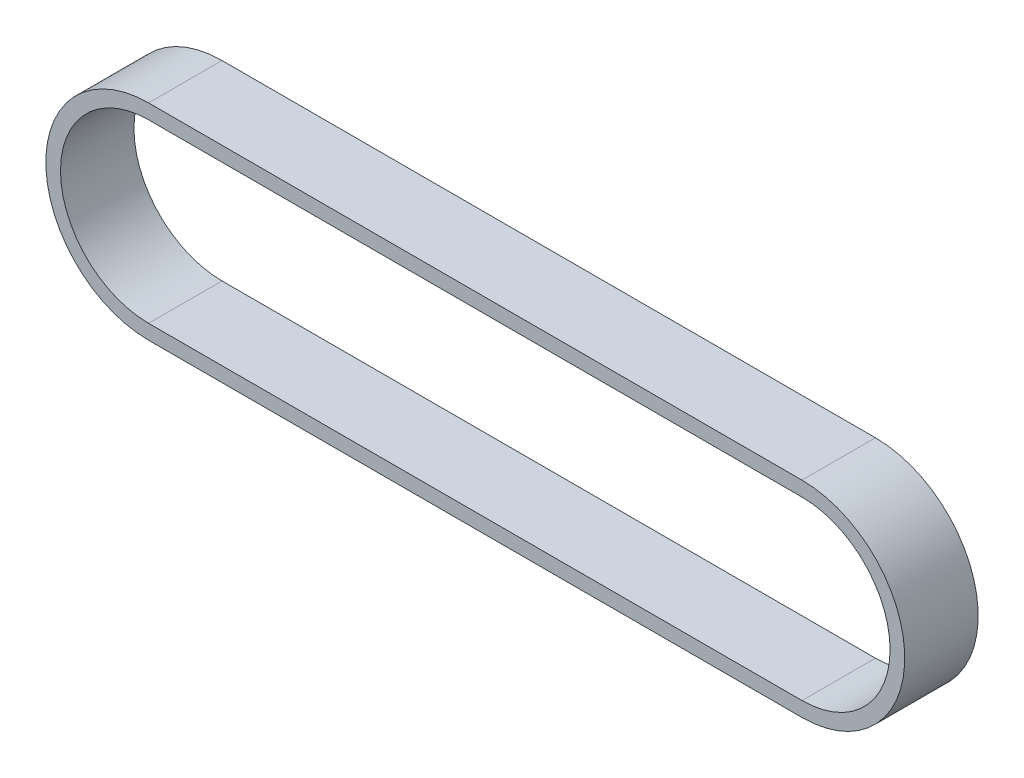
ISO-10303-21;
HEADER;
FILE_DESCRIPTION(('STEP AP214'),'2;1');
FILE_NAME('part.step','',(''),(''),'','','');
FILE_SCHEMA(('AUTOMOTIVE_DESIGN { 1 0 10303 214 1 1 1 1 }'));
ENDSEC;
DATA;
#1=APPLICATION_CONTEXT('core data for automotive mechanical design processes');
#2=APPLICATION_PROTOCOL_DEFINITION('international standard','automotive_design',2000,#1);
#3=PRODUCT_CONTEXT('',#1,'mechanical');
#4=PRODUCT('Part','Part','',(#3));
#5=PRODUCT_RELATED_PRODUCT_CATEGORY('part','',(#4));
#6=PRODUCT_DEFINITION_FORMATION('','',#4);
#7=PRODUCT_DEFINITION_CONTEXT('part definition',#1,'design');
#8=PRODUCT_DEFINITION('design','',#6,#7);
#9=PRODUCT_DEFINITION_SHAPE('','',#8);
#10=(LENGTH_UNIT() NAMED_UNIT(*) SI_UNIT(.MILLI.,.METRE.));
#11=(NAMED_UNIT(*) PLANE_ANGLE_UNIT() SI_UNIT($,.RADIAN.));
#12=(NAMED_UNIT(*) SI_UNIT($,.STERADIAN.) SOLID_ANGLE_UNIT());
#13=UNCERTAINTY_MEASURE_WITH_UNIT(LENGTH_MEASURE(1.E-05),#10,'distance_accuracy_value','');
#14=(GEOMETRIC_REPRESENTATION_CONTEXT(3) GLOBAL_UNCERTAINTY_ASSIGNED_CONTEXT((#13)) GLOBAL_UNIT_ASSIGNED_CONTEXT((#10,
#11,#12)) REPRESENTATION_CONTEXT('',''));
#15=CARTESIAN_POINT('',(0.,0.,0.));
#16=DIRECTION('',(0.,0.,1.));
#17=DIRECTION('',(1.,0.,0.));
#18=AXIS2_PLACEMENT_3D('',#15,#16,#17);
#19=CARTESIAN_POINT('',(0.,0.,10.));
#20=DIRECTION('',(0.,0.,1.));
#21=DIRECTION('',(1.,0.,0.));
#22=AXIS2_PLACEMENT_3D('',#19,#20,#21);
#23=PLANE('',#22);
#24=CARTESIAN_POINT('',(0.,0.,10.));
#25=DIRECTION('',(0.,0.,1.));
#26=DIRECTION('',(1.,0.,0.));
#27=AXIS2_PLACEMENT_3D('',#24,#25,#26);
#28=CIRCLE('',#27,14.);
#29=CARTESIAN_POINT('',(0.,14.,10.));
#30=VERTEX_POINT('',#29);
#31=CARTESIAN_POINT('',(0.,-14.,10.));
#32=VERTEX_POINT('',#31);
#33=EDGE_CURVE('E144',#30,#32,#28,.T.);
#34=ORIENTED_EDGE('',*,*,#33,.T.);
#35=DIRECTION('',(1.,0.,0.));
#36=VECTOR('',#35,1.);
#37=CARTESIAN_POINT('',(0.,-14.,10.));
#38=LINE('',#37,#36);
#39=CARTESIAN_POINT('',(89.,-14.,10.));
#40=VERTEX_POINT('',#39);
#41=EDGE_CURVE('E147',#32,#40,#38,.T.);
#42=ORIENTED_EDGE('',*,*,#41,.T.);
#43=CARTESIAN_POINT('',(89.,0.,10.));
#44=DIRECTION('',(0.,0.,1.));
#45=DIRECTION('',(1.,0.,0.));
#46=AXIS2_PLACEMENT_3D('',#43,#44,#45);
#47=CIRCLE('',#46,14.);
#48=CARTESIAN_POINT('',(89.,14.,10.));
#49=VERTEX_POINT('',#48);
#50=EDGE_CURVE('E150',#40,#49,#47,.T.);
#51=ORIENTED_EDGE('',*,*,#50,.T.);
#52=DIRECTION('',(-1.,0.,0.));
#53=VECTOR('',#52,1.);
#54=CARTESIAN_POINT('',(0.,14.,10.));
#55=LINE('',#54,#53);
#56=EDGE_CURVE('E152',#49,#30,#55,.T.);
#57=ORIENTED_EDGE('',*,*,#56,.T.);
#58=EDGE_LOOP('',(#34,#42,#51,#57));
#59=FACE_BOUND('',#58,.T.);
#60=DIRECTION('',(1.,0.,0.));
#61=VECTOR('',#60,1.);
#62=CARTESIAN_POINT('',(0.,-12.,10.));
#63=LINE('',#62,#61);
#64=CARTESIAN_POINT('',(0.,-12.,10.));
#65=VERTEX_POINT('',#64);
#66=CARTESIAN_POINT('',(89.,-12.,10.));
#67=VERTEX_POINT('',#66);
#68=EDGE_CURVE('E116',#65,#67,#63,.T.);
#69=ORIENTED_EDGE('',*,*,#68,.F.);
#70=CARTESIAN_POINT('',(0.,0.,10.));
#71=DIRECTION('',(0.,0.,1.));
#72=DIRECTION('',(1.,0.,0.));
#73=AXIS2_PLACEMENT_3D('',#70,#71,#72);
#74=CIRCLE('',#73,12.);
#75=CARTESIAN_POINT('',(0.,12.,10.));
#76=VERTEX_POINT('',#75);
#77=EDGE_CURVE('E108',#76,#65,#74,.T.);
#78=ORIENTED_EDGE('',*,*,#77,.F.);
#79=DIRECTION('',(-1.,0.,0.));
#80=VECTOR('',#79,1.);
#81=CARTESIAN_POINT('',(0.,12.,10.));
#82=LINE('',#81,#80);
#83=CARTESIAN_POINT('',(89.,12.,10.));
#84=VERTEX_POINT('',#83);
#85=EDGE_CURVE('E130',#84,#76,#82,.T.);
#86=ORIENTED_EDGE('',*,*,#85,.F.);
#87=CARTESIAN_POINT('',(89.,0.,10.));
#88=DIRECTION('',(0.,0.,1.));
#89=DIRECTION('',(1.,0.,0.));
#90=AXIS2_PLACEMENT_3D('',#87,#88,#89);
#91=CIRCLE('',#90,12.);
#92=EDGE_CURVE('E128',#67,#84,#91,.T.);
#93=ORIENTED_EDGE('',*,*,#92,.F.);
#94=EDGE_LOOP('',(#69,#78,#86,#93));
#95=FACE_BOUND('',#94,.T.);
#96=ADVANCED_FACE('F43',(#59,#95),#23,.T.);
#97=CARTESIAN_POINT('',(0.,0.,0.));
#98=DIRECTION('',(0.,0.,1.));
#99=DIRECTION('',(1.,0.,0.));
#100=AXIS2_PLACEMENT_3D('',#97,#98,#99);
#101=PLANE('',#100);
#102=CARTESIAN_POINT('',(0.,0.,0.));
#103=DIRECTION('',(0.,0.,1.));
#104=DIRECTION('',(1.,0.,0.));
#105=AXIS2_PLACEMENT_3D('',#102,#103,#104);
#106=CIRCLE('',#105,14.);
#107=CARTESIAN_POINT('',(0.,14.,0.));
#108=VERTEX_POINT('',#107);
#109=CARTESIAN_POINT('',(0.,-14.,0.));
#110=VERTEX_POINT('',#109);
#111=EDGE_CURVE('E124',#108,#110,#106,.T.);
#112=ORIENTED_EDGE('',*,*,#111,.F.);
#113=DIRECTION('',(-1.,0.,0.));
#114=VECTOR('',#113,1.);
#115=CARTESIAN_POINT('',(0.,14.,0.));
#116=LINE('',#115,#114);
#117=CARTESIAN_POINT('',(89.,14.,0.));
#118=VERTEX_POINT('',#117);
#119=EDGE_CURVE('E148',#118,#108,#116,.T.);
#120=ORIENTED_EDGE('',*,*,#119,.F.);
#121=CARTESIAN_POINT('',(89.,0.,0.));
#122=DIRECTION('',(0.,0.,1.));
#123=DIRECTION('',(1.,0.,0.));
#124=AXIS2_PLACEMENT_3D('',#121,#122,#123);
#125=CIRCLE('',#124,14.);
#126=CARTESIAN_POINT('',(89.,-14.,0.));
#127=VERTEX_POINT('',#126);
#128=EDGE_CURVE('E159',#127,#118,#125,.T.);
#129=ORIENTED_EDGE('',*,*,#128,.F.);
#130=DIRECTION('',(1.,0.,0.));
#131=VECTOR('',#130,1.);
#132=CARTESIAN_POINT('',(0.,-14.,0.));
#133=LINE('',#132,#131);
#134=EDGE_CURVE('E157',#110,#127,#133,.T.);
#135=ORIENTED_EDGE('',*,*,#134,.F.);
#136=EDGE_LOOP('',(#112,#120,#129,#135));
#137=FACE_BOUND('',#136,.T.);
#138=CARTESIAN_POINT('',(0.,0.,0.));
#139=DIRECTION('',(0.,0.,1.));
#140=DIRECTION('',(1.,0.,0.));
#141=AXIS2_PLACEMENT_3D('',#138,#139,#140);
#142=CIRCLE('',#141,12.);
#143=CARTESIAN_POINT('',(0.,12.,0.));
#144=VERTEX_POINT('',#143);
#145=CARTESIAN_POINT('',(0.,-12.,0.));
#146=VERTEX_POINT('',#145);
#147=EDGE_CURVE('E66',#144,#146,#142,.T.);
#148=ORIENTED_EDGE('',*,*,#147,.T.);
#149=DIRECTION('',(1.,0.,0.));
#150=VECTOR('',#149,1.);
#151=CARTESIAN_POINT('',(0.,-12.,0.));
#152=LINE('',#151,#150);
#153=CARTESIAN_POINT('',(89.,-12.,0.));
#154=VERTEX_POINT('',#153);
#155=EDGE_CURVE('E123',#146,#154,#152,.T.);
#156=ORIENTED_EDGE('',*,*,#155,.T.);
#157=CARTESIAN_POINT('',(89.,0.,0.));
#158=DIRECTION('',(0.,0.,1.));
#159=DIRECTION('',(1.,0.,0.));
#160=AXIS2_PLACEMENT_3D('',#157,#158,#159);
#161=CIRCLE('',#160,12.);
#162=CARTESIAN_POINT('',(89.,12.,0.));
#163=VERTEX_POINT('',#162);
#164=EDGE_CURVE('E136',#154,#163,#161,.T.);
#165=ORIENTED_EDGE('',*,*,#164,.T.);
#166=DIRECTION('',(-1.,0.,0.));
#167=VECTOR('',#166,1.);
#168=CARTESIAN_POINT('',(0.,12.,0.));
#169=LINE('',#168,#167);
#170=EDGE_CURVE('E117',#163,#144,#169,.T.);
#171=ORIENTED_EDGE('',*,*,#170,.T.);
#172=EDGE_LOOP('',(#148,#156,#165,#171));
#173=FACE_BOUND('',#172,.T.);
#174=ADVANCED_FACE('F177',(#137,#173),#101,.F.);
#175=CARTESIAN_POINT('',(0.,0.,10.));
#176=DIRECTION('',(0.,0.,-1.));
#177=DIRECTION('',(-1.,0.,0.));
#178=AXIS2_PLACEMENT_3D('',#175,#176,#177);
#179=CYLINDRICAL_SURFACE('',#178,14.);
#180=ORIENTED_EDGE('',*,*,#111,.T.);
#181=DIRECTION('',(0.,0.,-1.));
#182=VECTOR('',#181,1.);
#183=CARTESIAN_POINT('',(0.,-14.,10.));
#184=LINE('',#183,#182);
#185=EDGE_CURVE('E11',#32,#110,#184,.T.);
#186=ORIENTED_EDGE('',*,*,#185,.F.);
#187=ORIENTED_EDGE('',*,*,#33,.F.);
#188=DIRECTION('',(0.,0.,-1.));
#189=VECTOR('',#188,1.);
#190=CARTESIAN_POINT('',(0.,14.,10.));
#191=LINE('',#190,#189);
#192=EDGE_CURVE('E154',#30,#108,#191,.T.);
#193=ORIENTED_EDGE('',*,*,#192,.T.);
#194=EDGE_LOOP('',(#180,#186,#187,#193));
#195=FACE_BOUND('',#194,.T.);
#196=ADVANCED_FACE('F45',(#195),#179,.T.);
#197=CARTESIAN_POINT('',(0.,-14.,10.));
#198=DIRECTION('',(0.,1.,0.));
#199=DIRECTION('',(0.,0.,1.));
#200=AXIS2_PLACEMENT_3D('',#197,#198,#199);
#201=PLANE('',#200);
#202=ORIENTED_EDGE('',*,*,#134,.T.);
#203=DIRECTION('',(0.,0.,-1.));
#204=VECTOR('',#203,1.);
#205=CARTESIAN_POINT('',(89.,-14.,10.));
#206=LINE('',#205,#204);
#207=EDGE_CURVE('E51',#40,#127,#206,.T.);
#208=ORIENTED_EDGE('',*,*,#207,.F.);
#209=ORIENTED_EDGE('',*,*,#41,.F.);
#210=ORIENTED_EDGE('',*,*,#185,.T.);
#211=EDGE_LOOP('',(#202,#208,#209,#210));
#212=FACE_BOUND('',#211,.T.);
#213=ADVANCED_FACE('F187',(#212),#201,.F.);
#214=CARTESIAN_POINT('',(89.,0.,10.));
#215=DIRECTION('',(0.,0.,-1.));
#216=DIRECTION('',(-1.,0.,0.));
#217=AXIS2_PLACEMENT_3D('',#214,#215,#216);
#218=CYLINDRICAL_SURFACE('',#217,14.);
#219=ORIENTED_EDGE('',*,*,#128,.T.);
#220=DIRECTION('',(0.,0.,-1.));
#221=VECTOR('',#220,1.);
#222=CARTESIAN_POINT('',(89.,14.,10.));
#223=LINE('',#222,#221);
#224=EDGE_CURVE('E164',#49,#118,#223,.T.);
#225=ORIENTED_EDGE('',*,*,#224,.F.);
#226=ORIENTED_EDGE('',*,*,#50,.F.);
#227=ORIENTED_EDGE('',*,*,#207,.T.);
#228=EDGE_LOOP('',(#219,#225,#226,#227));
#229=FACE_BOUND('',#228,.T.);
#230=ADVANCED_FACE('F171',(#229),#218,.T.);
#231=CARTESIAN_POINT('',(0.,14.,10.));
#232=DIRECTION('',(0.,-1.,0.));
#233=DIRECTION('',(0.,0.,-1.));
#234=AXIS2_PLACEMENT_3D('',#231,#232,#233);
#235=PLANE('',#234);
#236=ORIENTED_EDGE('',*,*,#119,.T.);
#237=ORIENTED_EDGE('',*,*,#192,.F.);
#238=ORIENTED_EDGE('',*,*,#56,.F.);
#239=ORIENTED_EDGE('',*,*,#224,.T.);
#240=EDGE_LOOP('',(#236,#237,#238,#239));
#241=FACE_BOUND('',#240,.T.);
#242=ADVANCED_FACE('F181',(#241),#235,.F.);
#243=CARTESIAN_POINT('',(0.,0.,10.));
#244=DIRECTION('',(0.,0.,-1.));
#245=DIRECTION('',(-1.,0.,0.));
#246=AXIS2_PLACEMENT_3D('',#243,#244,#245);
#247=CYLINDRICAL_SURFACE('',#246,12.);
#248=ORIENTED_EDGE('',*,*,#147,.F.);
#249=DIRECTION('',(0.,0.,-1.));
#250=VECTOR('',#249,1.);
#251=CARTESIAN_POINT('',(0.,12.,10.));
#252=LINE('',#251,#250);
#253=EDGE_CURVE('E112',#76,#144,#252,.T.);
#254=ORIENTED_EDGE('',*,*,#253,.F.);
#255=ORIENTED_EDGE('',*,*,#77,.T.);
#256=DIRECTION('',(0.,0.,-1.));
#257=VECTOR('',#256,1.);
#258=CARTESIAN_POINT('',(0.,-12.,10.));
#259=LINE('',#258,#257);
#260=EDGE_CURVE('E111',#65,#146,#259,.T.);
#261=ORIENTED_EDGE('',*,*,#260,.T.);
#262=EDGE_LOOP('',(#248,#254,#255,#261));
#263=FACE_BOUND('',#262,.T.);
#264=ADVANCED_FACE('F110',(#263),#247,.F.);
#265=CARTESIAN_POINT('',(0.,-12.,10.));
#266=DIRECTION('',(0.,1.,0.));
#267=DIRECTION('',(0.,0.,1.));
#268=AXIS2_PLACEMENT_3D('',#265,#266,#267);
#269=PLANE('',#268);
#270=ORIENTED_EDGE('',*,*,#155,.F.);
#271=ORIENTED_EDGE('',*,*,#260,.F.);
#272=ORIENTED_EDGE('',*,*,#68,.T.);
#273=DIRECTION('',(0.,0.,-1.));
#274=VECTOR('',#273,1.);
#275=CARTESIAN_POINT('',(89.,-12.,10.));
#276=LINE('',#275,#274);
#277=EDGE_CURVE('E125',#67,#154,#276,.T.);
#278=ORIENTED_EDGE('',*,*,#277,.T.);
#279=EDGE_LOOP('',(#270,#271,#272,#278));
#280=FACE_BOUND('',#279,.T.);
#281=ADVANCED_FACE('F120',(#280),#269,.T.);
#282=CARTESIAN_POINT('',(89.,0.,10.));
#283=DIRECTION('',(0.,0.,-1.));
#284=DIRECTION('',(-1.,0.,0.));
#285=AXIS2_PLACEMENT_3D('',#282,#283,#284);
#286=CYLINDRICAL_SURFACE('',#285,12.);
#287=ORIENTED_EDGE('',*,*,#164,.F.);
#288=ORIENTED_EDGE('',*,*,#277,.F.);
#289=ORIENTED_EDGE('',*,*,#92,.T.);
#290=DIRECTION('',(0.,0.,-1.));
#291=VECTOR('',#290,1.);
#292=CARTESIAN_POINT('',(89.,12.,10.));
#293=LINE('',#292,#291);
#294=EDGE_CURVE('E58',#84,#163,#293,.T.);
#295=ORIENTED_EDGE('',*,*,#294,.T.);
#296=EDGE_LOOP('',(#287,#288,#289,#295));
#297=FACE_BOUND('',#296,.T.);
#298=ADVANCED_FACE('F210',(#297),#286,.F.);
#299=CARTESIAN_POINT('',(0.,12.,10.));
#300=DIRECTION('',(0.,-1.,0.));
#301=DIRECTION('',(0.,0.,-1.));
#302=AXIS2_PLACEMENT_3D('',#299,#300,#301);
#303=PLANE('',#302);
#304=ORIENTED_EDGE('',*,*,#170,.F.);
#305=ORIENTED_EDGE('',*,*,#294,.F.);
#306=ORIENTED_EDGE('',*,*,#85,.T.);
#307=ORIENTED_EDGE('',*,*,#253,.T.);
#308=EDGE_LOOP('',(#304,#305,#306,#307));
#309=FACE_BOUND('',#308,.T.);
#310=ADVANCED_FACE('F214',(#309),#303,.T.);
#311=CLOSED_SHELL('',(#96,#174,#196,#213,#230,#242,#264,#281,#298,#310));
#312=MANIFOLD_SOLID_BREP('B2',#311);
#313=ADVANCED_BREP_SHAPE_REPRESENTATION('',(#18,#312),#14);
#314=SHAPE_DEFINITION_REPRESENTATION(#9,#313);
ENDSEC;
END-ISO-10303-21;
